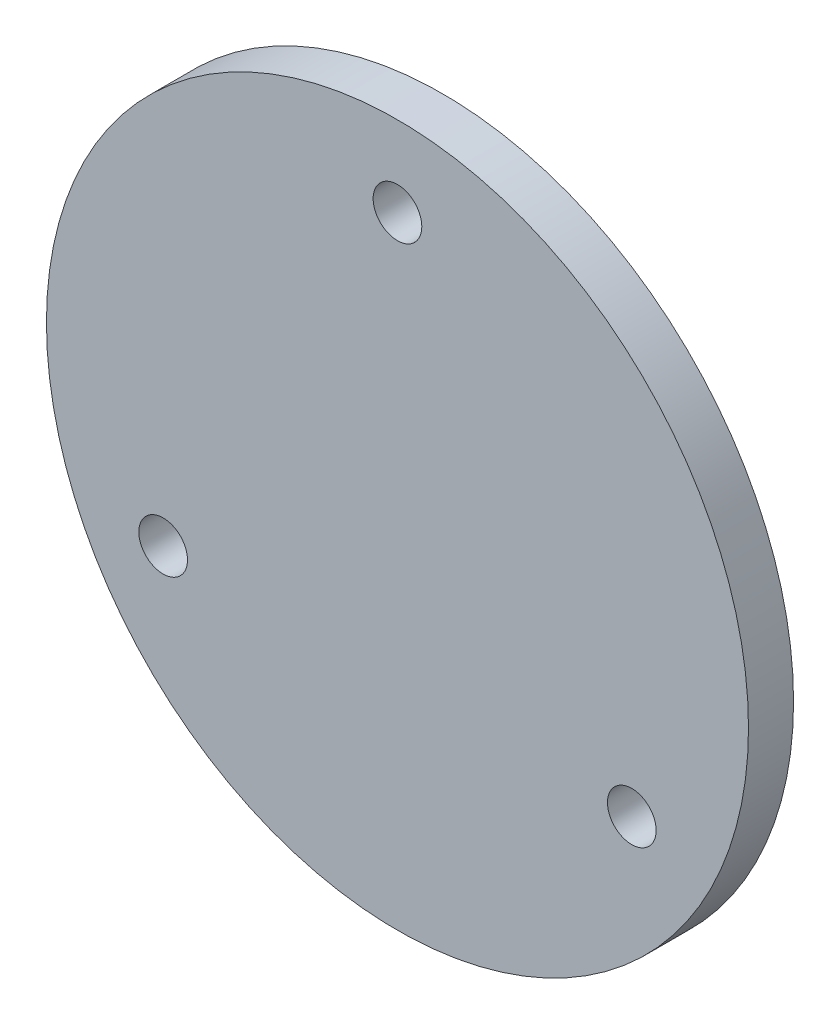
ISO-10303-21;
HEADER;
FILE_DESCRIPTION(('STEP AP214'),'2;1');
FILE_NAME('part.step','',(''),(''),'','','');
FILE_SCHEMA(('AUTOMOTIVE_DESIGN { 1 0 10303 214 1 1 1 1 }'));
ENDSEC;
DATA;
#1=APPLICATION_CONTEXT('core data for automotive mechanical design processes');
#2=APPLICATION_PROTOCOL_DEFINITION('international standard','automotive_design',2000,#1);
#3=PRODUCT_CONTEXT('',#1,'mechanical');
#4=PRODUCT('Part','Part','',(#3));
#5=PRODUCT_RELATED_PRODUCT_CATEGORY('part','',(#4));
#6=PRODUCT_DEFINITION_FORMATION('','',#4);
#7=PRODUCT_DEFINITION_CONTEXT('part definition',#1,'design');
#8=PRODUCT_DEFINITION('design','',#6,#7);
#9=PRODUCT_DEFINITION_SHAPE('','',#8);
#10=(LENGTH_UNIT() NAMED_UNIT(*) SI_UNIT(.MILLI.,.METRE.));
#11=(NAMED_UNIT(*) PLANE_ANGLE_UNIT() SI_UNIT($,.RADIAN.));
#12=(NAMED_UNIT(*) SI_UNIT($,.STERADIAN.) SOLID_ANGLE_UNIT());
#13=UNCERTAINTY_MEASURE_WITH_UNIT(LENGTH_MEASURE(1.E-05),#10,'distance_accuracy_value','');
#14=(GEOMETRIC_REPRESENTATION_CONTEXT(3) GLOBAL_UNCERTAINTY_ASSIGNED_CONTEXT((#13)) GLOBAL_UNIT_ASSIGNED_CONTEXT((#10,
#11,#12)) REPRESENTATION_CONTEXT('',''));
#15=CARTESIAN_POINT('',(0.,0.,0.));
#16=DIRECTION('',(0.,0.,1.));
#17=DIRECTION('',(1.,0.,0.));
#18=AXIS2_PLACEMENT_3D('',#15,#16,#17);
#19=CARTESIAN_POINT('',(0.,0.,6.35));
#20=DIRECTION('',(0.,0.,-1.));
#21=DIRECTION('',(-1.,0.,0.));
#22=AXIS2_PLACEMENT_3D('',#19,#20,#21);
#23=CYLINDRICAL_SURFACE('',#22,49.4665);
#24=CARTESIAN_POINT('',(0.,0.,6.35));
#25=DIRECTION('',(0.,0.,1.));
#26=DIRECTION('',(1.,0.,0.));
#27=AXIS2_PLACEMENT_3D('',#24,#25,#26);
#28=CIRCLE('',#27,49.4665);
#29=CARTESIAN_POINT('',(49.4665,0.,6.35));
#30=VERTEX_POINT('',#29);
#31=EDGE_CURVE('E10',#30,#30,#28,.T.);
#32=ORIENTED_EDGE('',*,*,#31,.F.);
#33=EDGE_LOOP('',(#32));
#34=FACE_BOUND('',#33,.T.);
#35=CARTESIAN_POINT('',(0.,0.,0.));
#36=DIRECTION('',(0.,0.,1.));
#37=DIRECTION('',(1.,0.,0.));
#38=AXIS2_PLACEMENT_3D('',#35,#36,#37);
#39=CIRCLE('',#38,49.4665);
#40=CARTESIAN_POINT('',(49.4665,0.,0.));
#41=VERTEX_POINT('',#40);
#42=EDGE_CURVE('E34',#41,#41,#39,.T.);
#43=ORIENTED_EDGE('',*,*,#42,.T.);
#44=EDGE_LOOP('',(#43));
#45=FACE_BOUND('',#44,.T.);
#46=ADVANCED_FACE('F31',(#34,#45),#23,.T.);
#47=CARTESIAN_POINT('',(0.,0.,6.35));
#48=DIRECTION('',(0.,0.,1.));
#49=DIRECTION('',(1.,0.,0.));
#50=AXIS2_PLACEMENT_3D('',#47,#48,#49);
#51=PLANE('',#50);
#52=CARTESIAN_POINT('',(0.,38.128211777283,6.35));
#53=DIRECTION('',(0.,0.,1.));
#54=DIRECTION('',(1.,0.,0.));
#55=AXIS2_PLACEMENT_3D('',#52,#53,#54);
#56=CIRCLE('',#55,3.429);
#57=CARTESIAN_POINT('',(3.429,38.128211777283,6.35));
#58=VERTEX_POINT('',#57);
#59=EDGE_CURVE('E55',#58,#58,#56,.T.);
#60=ORIENTED_EDGE('',*,*,#59,.F.);
#61=EDGE_LOOP('',(#60));
#62=FACE_BOUND('',#61,.T.);
#63=CARTESIAN_POINT('',(-33.0200000000003,-19.0641058886412,6.35));
#64=DIRECTION('',(0.,0.,1.));
#65=DIRECTION('',(1.,0.,0.));
#66=AXIS2_PLACEMENT_3D('',#63,#64,#65);
#67=CIRCLE('',#66,3.429);
#68=CARTESIAN_POINT('',(-29.5910000000003,-19.0641058886412,6.35));
#69=VERTEX_POINT('',#68);
#70=EDGE_CURVE('E49',#69,#69,#67,.T.);
#71=ORIENTED_EDGE('',*,*,#70,.F.);
#72=EDGE_LOOP('',(#71));
#73=FACE_BOUND('',#72,.T.);
#74=CARTESIAN_POINT('',(33.0200000000003,-19.0641058886412,6.35));
#75=DIRECTION('',(0.,0.,1.));
#76=DIRECTION('',(1.,0.,0.));
#77=AXIS2_PLACEMENT_3D('',#74,#75,#76);
#78=CIRCLE('',#77,3.429);
#79=CARTESIAN_POINT('',(36.4490000000003,-19.0641058886412,6.35));
#80=VERTEX_POINT('',#79);
#81=EDGE_CURVE('E43',#80,#80,#78,.T.);
#82=ORIENTED_EDGE('',*,*,#81,.F.);
#83=EDGE_LOOP('',(#82));
#84=FACE_BOUND('',#83,.T.);
#85=ORIENTED_EDGE('',*,*,#31,.T.);
#86=EDGE_LOOP('',(#85));
#87=FACE_BOUND('',#86,.T.);
#88=ADVANCED_FACE('F71',(#62,#73,#84,#87),#51,.T.);
#89=CARTESIAN_POINT('',(0.,0.,0.));
#90=DIRECTION('',(0.,0.,1.));
#91=DIRECTION('',(1.,0.,0.));
#92=AXIS2_PLACEMENT_3D('',#89,#90,#91);
#93=PLANE('',#92);
#94=CARTESIAN_POINT('',(0.,38.128211777283,0.));
#95=DIRECTION('',(0.,0.,1.));
#96=DIRECTION('',(1.,0.,0.));
#97=AXIS2_PLACEMENT_3D('',#94,#95,#96);
#98=CIRCLE('',#97,3.429);
#99=CARTESIAN_POINT('',(3.429,38.128211777283,0.));
#100=VERTEX_POINT('',#99);
#101=EDGE_CURVE('E41',#100,#100,#98,.T.);
#102=ORIENTED_EDGE('',*,*,#101,.T.);
#103=EDGE_LOOP('',(#102));
#104=FACE_BOUND('',#103,.T.);
#105=CARTESIAN_POINT('',(-33.0200000000003,-19.0641058886412,0.));
#106=DIRECTION('',(0.,0.,1.));
#107=DIRECTION('',(1.,0.,0.));
#108=AXIS2_PLACEMENT_3D('',#105,#106,#107);
#109=CIRCLE('',#108,3.429);
#110=CARTESIAN_POINT('',(-29.5910000000003,-19.0641058886412,0.));
#111=VERTEX_POINT('',#110);
#112=EDGE_CURVE('E52',#111,#111,#109,.T.);
#113=ORIENTED_EDGE('',*,*,#112,.T.);
#114=EDGE_LOOP('',(#113));
#115=FACE_BOUND('',#114,.T.);
#116=CARTESIAN_POINT('',(33.0200000000003,-19.0641058886412,0.));
#117=DIRECTION('',(0.,0.,1.));
#118=DIRECTION('',(1.,0.,0.));
#119=AXIS2_PLACEMENT_3D('',#116,#117,#118);
#120=CIRCLE('',#119,3.429);
#121=CARTESIAN_POINT('',(36.4490000000003,-19.0641058886412,0.));
#122=VERTEX_POINT('',#121);
#123=EDGE_CURVE('E46',#122,#122,#120,.T.);
#124=ORIENTED_EDGE('',*,*,#123,.T.);
#125=EDGE_LOOP('',(#124));
#126=FACE_BOUND('',#125,.T.);
#127=ORIENTED_EDGE('',*,*,#42,.F.);
#128=EDGE_LOOP('',(#127));
#129=FACE_BOUND('',#128,.T.);
#130=ADVANCED_FACE('F61',(#104,#115,#126,#129),#93,.F.);
#131=CARTESIAN_POINT('',(33.0200000000003,-19.0641058886412,0.));
#132=DIRECTION('',(0.,0.,1.));
#133=DIRECTION('',(1.,0.,0.));
#134=AXIS2_PLACEMENT_3D('',#131,#132,#133);
#135=CYLINDRICAL_SURFACE('',#134,3.429);
#136=ORIENTED_EDGE('',*,*,#123,.F.);
#137=EDGE_LOOP('',(#136));
#138=FACE_BOUND('',#137,.T.);
#139=ORIENTED_EDGE('',*,*,#81,.T.);
#140=EDGE_LOOP('',(#139));
#141=FACE_BOUND('',#140,.T.);
#142=ADVANCED_FACE('F79',(#138,#141),#135,.F.);
#143=CARTESIAN_POINT('',(-33.0200000000003,-19.0641058886412,0.));
#144=DIRECTION('',(0.,0.,1.));
#145=DIRECTION('',(1.,0.,0.));
#146=AXIS2_PLACEMENT_3D('',#143,#144,#145);
#147=CYLINDRICAL_SURFACE('',#146,3.429);
#148=ORIENTED_EDGE('',*,*,#112,.F.);
#149=EDGE_LOOP('',(#148));
#150=FACE_BOUND('',#149,.T.);
#151=ORIENTED_EDGE('',*,*,#70,.T.);
#152=EDGE_LOOP('',(#151));
#153=FACE_BOUND('',#152,.T.);
#154=ADVANCED_FACE('F67',(#150,#153),#147,.F.);
#155=CARTESIAN_POINT('',(0.,38.128211777283,0.));
#156=DIRECTION('',(0.,0.,1.));
#157=DIRECTION('',(1.,0.,0.));
#158=AXIS2_PLACEMENT_3D('',#155,#156,#157);
#159=CYLINDRICAL_SURFACE('',#158,3.429);
#160=ORIENTED_EDGE('',*,*,#101,.F.);
#161=EDGE_LOOP('',(#160));
#162=FACE_BOUND('',#161,.T.);
#163=ORIENTED_EDGE('',*,*,#59,.T.);
#164=EDGE_LOOP('',(#163));
#165=FACE_BOUND('',#164,.T.);
#166=ADVANCED_FACE('F64',(#162,#165),#159,.F.);
#167=CLOSED_SHELL('',(#46,#88,#130,#142,#154,#166));
#168=MANIFOLD_SOLID_BREP('B2',#167);
#169=ADVANCED_BREP_SHAPE_REPRESENTATION('',(#18,#168),#14);
#170=SHAPE_DEFINITION_REPRESENTATION(#9,#169);
ENDSEC;
END-ISO-10303-21;
